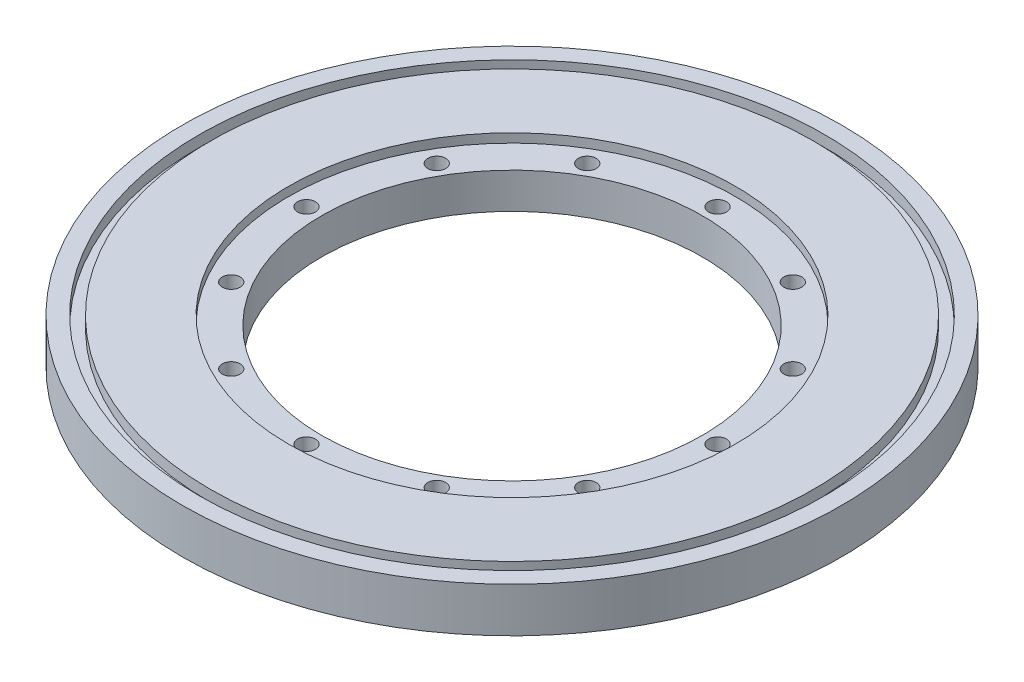
ISO-10303-21;
HEADER;
FILE_DESCRIPTION(('STEP AP214'),'2;1');
FILE_NAME('part.step','',(''),(''),'','','');
FILE_SCHEMA(('AUTOMOTIVE_DESIGN { 1 0 10303 214 1 1 1 1 }'));
ENDSEC;
DATA;
#1=APPLICATION_CONTEXT('core data for automotive mechanical design processes');
#2=APPLICATION_PROTOCOL_DEFINITION('international standard','automotive_design',2000,#1);
#3=PRODUCT_CONTEXT('',#1,'mechanical');
#4=PRODUCT('Part','Part','',(#3));
#5=PRODUCT_RELATED_PRODUCT_CATEGORY('part','',(#4));
#6=PRODUCT_DEFINITION_FORMATION('','',#4);
#7=PRODUCT_DEFINITION_CONTEXT('part definition',#1,'design');
#8=PRODUCT_DEFINITION('design','',#6,#7);
#9=PRODUCT_DEFINITION_SHAPE('','',#8);
#10=(LENGTH_UNIT() NAMED_UNIT(*) SI_UNIT(.MILLI.,.METRE.));
#11=(NAMED_UNIT(*) PLANE_ANGLE_UNIT() SI_UNIT($,.RADIAN.));
#12=(NAMED_UNIT(*) SI_UNIT($,.STERADIAN.) SOLID_ANGLE_UNIT());
#13=UNCERTAINTY_MEASURE_WITH_UNIT(LENGTH_MEASURE(1.E-05),#10,'distance_accuracy_value','');
#14=(GEOMETRIC_REPRESENTATION_CONTEXT(3) GLOBAL_UNCERTAINTY_ASSIGNED_CONTEXT((#13)) GLOBAL_UNIT_ASSIGNED_CONTEXT((#10,
#11,#12)) REPRESENTATION_CONTEXT('',''));
#15=CARTESIAN_POINT('',(0.,0.,0.));
#16=DIRECTION('',(0.,0.,1.));
#17=DIRECTION('',(1.,0.,0.));
#18=AXIS2_PLACEMENT_3D('',#15,#16,#17);
#19=CARTESIAN_POINT('',(0.,12.7,0.));
#20=DIRECTION('',(0.,1.,0.));
#21=DIRECTION('',(0.,0.,1.));
#22=AXIS2_PLACEMENT_3D('',#19,#20,#21);
#23=PLANE('',#22);
#24=CARTESIAN_POINT('',(0.,12.7,0.));
#25=DIRECTION('',(0.,1.,0.));
#26=DIRECTION('',(0.,0.,1.));
#27=AXIS2_PLACEMENT_3D('',#24,#25,#26);
#28=CIRCLE('',#27,63.5);
#29=CARTESIAN_POINT('',(0.,12.7,63.5));
#30=VERTEX_POINT('',#29);
#31=EDGE_CURVE('E57',#30,#30,#28,.T.);
#32=ORIENTED_EDGE('',*,*,#31,.F.);
#33=EDGE_LOOP('',(#32));
#34=FACE_BOUND('',#33,.T.);
#35=CARTESIAN_POINT('',(0.,12.7,0.));
#36=DIRECTION('',(0.,1.,0.));
#37=DIRECTION('',(0.,0.,1.));
#38=AXIS2_PLACEMENT_3D('',#35,#36,#37);
#39=CIRCLE('',#38,85.725);
#40=CARTESIAN_POINT('',(0.,12.7,85.725));
#41=VERTEX_POINT('',#40);
#42=EDGE_CURVE('E113',#41,#41,#39,.T.);
#43=ORIENTED_EDGE('',*,*,#42,.T.);
#44=EDGE_LOOP('',(#43));
#45=FACE_BOUND('',#44,.T.);
#46=ADVANCED_FACE('F32',(#34,#45),#23,.T.);
#47=CARTESIAN_POINT('',(0.,0.,0.));
#48=DIRECTION('',(0.,1.,0.));
#49=DIRECTION('',(0.,0.,1.));
#50=AXIS2_PLACEMENT_3D('',#47,#48,#49);
#51=CYLINDRICAL_SURFACE('',#50,54.102);
#52=CARTESIAN_POINT('',(0.,0.,0.));
#53=DIRECTION('',(0.,1.,0.));
#54=DIRECTION('',(0.,0.,1.));
#55=AXIS2_PLACEMENT_3D('',#52,#53,#54);
#56=CIRCLE('',#55,54.102);
#57=CARTESIAN_POINT('',(0.,0.,54.102));
#58=VERTEX_POINT('',#57);
#59=EDGE_CURVE('E45',#58,#58,#56,.T.);
#60=ORIENTED_EDGE('',*,*,#59,.F.);
#61=EDGE_LOOP('',(#60));
#62=FACE_BOUND('',#61,.T.);
#63=CARTESIAN_POINT('',(0.,10.16,0.));
#64=DIRECTION('',(0.,1.,0.));
#65=DIRECTION('',(0.,0.,1.));
#66=AXIS2_PLACEMENT_3D('',#63,#64,#65);
#67=CIRCLE('',#66,54.102);
#68=CARTESIAN_POINT('',(0.,10.16,54.102));
#69=VERTEX_POINT('',#68);
#70=EDGE_CURVE('E50',#69,#69,#67,.F.);
#71=ORIENTED_EDGE('',*,*,#70,.F.);
#72=EDGE_LOOP('',(#71));
#73=FACE_BOUND('',#72,.T.);
#74=ADVANCED_FACE('F108',(#62,#73),#51,.F.);
#75=CARTESIAN_POINT('',(0.,12.7,0.));
#76=DIRECTION('',(0.,-1.,0.));
#77=DIRECTION('',(0.,0.,-1.));
#78=AXIS2_PLACEMENT_3D('',#75,#76,#77);
#79=CYLINDRICAL_SURFACE('',#78,93.6625);
#80=CARTESIAN_POINT('',(0.,12.7,0.));
#81=DIRECTION('',(0.,1.,0.));
#82=DIRECTION('',(0.,0.,1.));
#83=AXIS2_PLACEMENT_3D('',#80,#81,#82);
#84=CIRCLE('',#83,93.6625);
#85=CARTESIAN_POINT('',(0.,12.7,93.6625));
#86=VERTEX_POINT('',#85);
#87=EDGE_CURVE('E10',#86,#86,#84,.T.);
#88=ORIENTED_EDGE('',*,*,#87,.F.);
#89=EDGE_LOOP('',(#88));
#90=FACE_BOUND('',#89,.T.);
#91=CARTESIAN_POINT('',(0.,0.,0.));
#92=DIRECTION('',(0.,1.,0.));
#93=DIRECTION('',(0.,0.,1.));
#94=AXIS2_PLACEMENT_3D('',#91,#92,#93);
#95=CIRCLE('',#94,93.6625);
#96=CARTESIAN_POINT('',(0.,0.,93.6625));
#97=VERTEX_POINT('',#96);
#98=EDGE_CURVE('E40',#97,#97,#95,.T.);
#99=ORIENTED_EDGE('',*,*,#98,.T.);
#100=EDGE_LOOP('',(#99));
#101=FACE_BOUND('',#100,.T.);
#102=ADVANCED_FACE('F34',(#90,#101),#79,.T.);
#103=CARTESIAN_POINT('',(0.,12.7,0.));
#104=DIRECTION('',(0.,1.,0.));
#105=DIRECTION('',(0.,0.,1.));
#106=AXIS2_PLACEMENT_3D('',#103,#104,#105);
#107=CIRCLE('',#106,88.9);
#108=CARTESIAN_POINT('',(0.,12.7,88.9));
#109=VERTEX_POINT('',#108);
#110=EDGE_CURVE('E118',#109,#109,#107,.T.);
#111=ORIENTED_EDGE('',*,*,#110,.F.);
#112=EDGE_LOOP('',(#111));
#113=FACE_BOUND('',#112,.T.);
#114=ORIENTED_EDGE('',*,*,#87,.T.);
#115=EDGE_LOOP('',(#114));
#116=FACE_BOUND('',#115,.T.);
#117=ADVANCED_FACE('F110',(#113,#116),#23,.T.);
#118=CARTESIAN_POINT('',(0.,0.,0.));
#119=DIRECTION('',(0.,1.,0.));
#120=DIRECTION('',(0.,0.,1.));
#121=AXIS2_PLACEMENT_3D('',#118,#119,#120);
#122=PLANE('',#121);
#123=CARTESIAN_POINT('',(-50.593204089087,0.,-29.2099999999999));
#124=DIRECTION('',(0.,1.,0.));
#125=DIRECTION('',(0.86602540378444,0.,0.499999999999998));
#126=AXIS2_PLACEMENT_3D('',#123,#124,#125);
#127=CIRCLE('',#126,2.54);
#128=CARTESIAN_POINT('',(-48.3934995634745,0.,-27.9399999999999));
#129=VERTEX_POINT('',#128);
#130=EDGE_CURVE('E133',#129,#129,#127,.T.);
#131=ORIENTED_EDGE('',*,*,#130,.T.);
#132=EDGE_LOOP('',(#131));
#133=FACE_BOUND('',#132,.T.);
#134=CARTESIAN_POINT('',(-58.42,0.,2.03972339815216E-13));
#135=DIRECTION('',(0.,1.,0.));
#136=DIRECTION('',(1.,0.,0.));
#137=AXIS2_PLACEMENT_3D('',#134,#135,#136);
#138=CIRCLE('',#137,2.54);
#139=CARTESIAN_POINT('',(-55.88,0.,1.95103977214554E-13));
#140=VERTEX_POINT('',#139);
#141=EDGE_CURVE('E136',#140,#140,#138,.T.);
#142=ORIENTED_EDGE('',*,*,#141,.T.);
#143=EDGE_LOOP('',(#142));
#144=FACE_BOUND('',#143,.T.);
#145=CARTESIAN_POINT('',(-50.5932040890868,0.,29.2100000000002));
#146=DIRECTION('',(0.,1.,0.));
#147=DIRECTION('',(0.866025403784436,0.,-0.500000000000004));
#148=AXIS2_PLACEMENT_3D('',#145,#146,#147);
#149=CIRCLE('',#148,2.54);
#150=CARTESIAN_POINT('',(-48.3934995634743,0.,27.9400000000002));
#151=VERTEX_POINT('',#150);
#152=EDGE_CURVE('E139',#151,#151,#149,.T.);
#153=ORIENTED_EDGE('',*,*,#152,.T.);
#154=EDGE_LOOP('',(#153));
#155=FACE_BOUND('',#154,.T.);
#156=CARTESIAN_POINT('',(-29.2099999999997,0.,50.5932040890871));
#157=DIRECTION('',(0.,1.,0.));
#158=DIRECTION('',(0.499999999999995,0.,-0.866025403784442));
#159=AXIS2_PLACEMENT_3D('',#156,#157,#158);
#160=CIRCLE('',#159,2.54);
#161=CARTESIAN_POINT('',(-27.9399999999997,0.,48.3934995634746));
#162=VERTEX_POINT('',#161);
#163=EDGE_CURVE('E142',#162,#162,#160,.T.);
#164=ORIENTED_EDGE('',*,*,#163,.T.);
#165=EDGE_LOOP('',(#164));
#166=FACE_BOUND('',#165,.T.);
#167=CARTESIAN_POINT('',(0.,0.,58.42));
#168=DIRECTION('',(0.,1.,0.));
#169=DIRECTION('',(0.,0.,-1.));
#170=AXIS2_PLACEMENT_3D('',#167,#168,#169);
#171=CIRCLE('',#170,2.54);
#172=CARTESIAN_POINT('',(0.,0.,55.88));
#173=VERTEX_POINT('',#172);
#174=EDGE_CURVE('E145',#173,#173,#171,.T.);
#175=ORIENTED_EDGE('',*,*,#174,.T.);
#176=EDGE_LOOP('',(#175));
#177=FACE_BOUND('',#176,.T.);
#178=CARTESIAN_POINT('',(29.2100000000004,0.,50.5932040890867));
#179=DIRECTION('',(0.,1.,0.));
#180=DIRECTION('',(-0.500000000000007,0.,-0.866025403784435));
#181=AXIS2_PLACEMENT_3D('',#178,#179,#180);
#182=CIRCLE('',#181,2.54);
#183=CARTESIAN_POINT('',(27.9400000000004,0.,48.3934995634742));
#184=VERTEX_POINT('',#183);
#185=EDGE_CURVE('E148',#184,#184,#182,.T.);
#186=ORIENTED_EDGE('',*,*,#185,.T.);
#187=EDGE_LOOP('',(#186));
#188=FACE_BOUND('',#187,.T.);
#189=CARTESIAN_POINT('',(50.5932040890872,0.,29.2099999999995));
#190=DIRECTION('',(0.,1.,0.));
#191=DIRECTION('',(-0.866025403784443,0.,-0.499999999999992));
#192=AXIS2_PLACEMENT_3D('',#189,#190,#191);
#193=CIRCLE('',#192,2.54);
#194=CARTESIAN_POINT('',(48.3934995634747,0.,27.9399999999995));
#195=VERTEX_POINT('',#194);
#196=EDGE_CURVE('E151',#195,#195,#193,.T.);
#197=ORIENTED_EDGE('',*,*,#196,.T.);
#198=EDGE_LOOP('',(#197));
#199=FACE_BOUND('',#198,.T.);
#200=CARTESIAN_POINT('',(58.42,0.,-6.11917019445647E-13));
#201=DIRECTION('',(0.,1.,0.));
#202=DIRECTION('',(-1.,0.,0.));
#203=AXIS2_PLACEMENT_3D('',#200,#201,#202);
#204=CIRCLE('',#203,2.54);
#205=CARTESIAN_POINT('',(55.88,0.,-5.85311931643663E-13));
#206=VERTEX_POINT('',#205);
#207=EDGE_CURVE('E130',#206,#206,#204,.T.);
#208=ORIENTED_EDGE('',*,*,#207,.T.);
#209=EDGE_LOOP('',(#208));
#210=FACE_BOUND('',#209,.T.);
#211=CARTESIAN_POINT('',(50.5932040890866,0.,-29.2100000000006));
#212=DIRECTION('',(0.,1.,0.));
#213=DIRECTION('',(-0.866025403784433,0.,0.50000000000001));
#214=AXIS2_PLACEMENT_3D('',#211,#212,#213);
#215=CIRCLE('',#214,2.54);
#216=CARTESIAN_POINT('',(48.3934995634741,0.,-27.9400000000006));
#217=VERTEX_POINT('',#216);
#218=EDGE_CURVE('E127',#217,#217,#215,.T.);
#219=ORIENTED_EDGE('',*,*,#218,.T.);
#220=EDGE_LOOP('',(#219));
#221=FACE_BOUND('',#220,.T.);
#222=CARTESIAN_POINT('',(29.2099999999993,0.,-50.5932040890873));
#223=DIRECTION('',(0.,1.,0.));
#224=DIRECTION('',(-0.499999999999989,0.,0.866025403784445));
#225=AXIS2_PLACEMENT_3D('',#222,#223,#224);
#226=CIRCLE('',#225,2.54);
#227=CARTESIAN_POINT('',(27.9399999999994,0.,-48.3934995634748));
#228=VERTEX_POINT('',#227);
#229=EDGE_CURVE('E124',#228,#228,#226,.T.);
#230=ORIENTED_EDGE('',*,*,#229,.T.);
#231=EDGE_LOOP('',(#230));
#232=FACE_BOUND('',#231,.T.);
#233=CARTESIAN_POINT('',(-29.2100000000001,0.,-50.5932040890869));
#234=DIRECTION('',(0.,1.,0.));
#235=DIRECTION('',(0.500000000000001,0.,0.866025403784438));
#236=AXIS2_PLACEMENT_3D('',#233,#234,#235);
#237=CIRCLE('',#236,2.54);
#238=CARTESIAN_POINT('',(-27.9400000000001,0.,-48.3934995634744));
#239=VERTEX_POINT('',#238);
#240=EDGE_CURVE('E63',#239,#239,#237,.T.);
#241=ORIENTED_EDGE('',*,*,#240,.T.);
#242=EDGE_LOOP('',(#241));
#243=FACE_BOUND('',#242,.T.);
#244=CARTESIAN_POINT('',(0.,0.,-58.42));
#245=DIRECTION('',(0.,1.,0.));
#246=DIRECTION('',(0.,0.,1.));
#247=AXIS2_PLACEMENT_3D('',#244,#245,#246);
#248=CIRCLE('',#247,2.54);
#249=CARTESIAN_POINT('',(0.,0.,-55.88));
#250=VERTEX_POINT('',#249);
#251=EDGE_CURVE('E58',#250,#250,#248,.T.);
#252=ORIENTED_EDGE('',*,*,#251,.T.);
#253=EDGE_LOOP('',(#252));
#254=FACE_BOUND('',#253,.T.);
#255=ORIENTED_EDGE('',*,*,#59,.T.);
#256=EDGE_LOOP('',(#255));
#257=FACE_BOUND('',#256,.T.);
#258=ORIENTED_EDGE('',*,*,#98,.F.);
#259=EDGE_LOOP('',(#258));
#260=FACE_BOUND('',#259,.T.);
#261=ADVANCED_FACE('F156',(#133,#144,#155,#166,#177,#188,#199,#210,#221,#232,#243,#254,#257,
#260),#122,.F.);
#262=CARTESIAN_POINT('',(0.,10.16,0.));
#263=DIRECTION('',(0.,1.,0.));
#264=DIRECTION('',(0.,0.,1.));
#265=AXIS2_PLACEMENT_3D('',#262,#263,#264);
#266=PLANE('',#265);
#267=CARTESIAN_POINT('',(-50.593204089087,10.16,-29.2099999999999));
#268=DIRECTION('',(0.,1.,0.));
#269=DIRECTION('',(0.,0.,1.));
#270=AXIS2_PLACEMENT_3D('',#267,#268,#269);
#271=CIRCLE('',#270,2.54);
#272=CARTESIAN_POINT('',(-50.593204089087,10.16,-26.6699999999999));
#273=VERTEX_POINT('',#272);
#274=EDGE_CURVE('E36',#273,#273,#271,.T.);
#275=ORIENTED_EDGE('',*,*,#274,.F.);
#276=EDGE_LOOP('',(#275));
#277=FACE_BOUND('',#276,.T.);
#278=CARTESIAN_POINT('',(-58.42,10.16,2.03972339815216E-13));
#279=DIRECTION('',(0.,1.,0.));
#280=DIRECTION('',(0.,0.,1.));
#281=AXIS2_PLACEMENT_3D('',#278,#279,#280);
#282=CIRCLE('',#281,2.54);
#283=CARTESIAN_POINT('',(-58.42,10.16,2.5400000000002));
#284=VERTEX_POINT('',#283);
#285=EDGE_CURVE('E86',#284,#284,#282,.T.);
#286=ORIENTED_EDGE('',*,*,#285,.F.);
#287=EDGE_LOOP('',(#286));
#288=FACE_BOUND('',#287,.T.);
#289=CARTESIAN_POINT('',(-50.5932040890868,10.16,29.2100000000002));
#290=DIRECTION('',(0.,1.,0.));
#291=DIRECTION('',(0.,0.,1.));
#292=AXIS2_PLACEMENT_3D('',#289,#290,#291);
#293=CIRCLE('',#292,2.54);
#294=CARTESIAN_POINT('',(-50.5932040890868,10.16,31.7500000000002));
#295=VERTEX_POINT('',#294);
#296=EDGE_CURVE('E84',#295,#295,#293,.T.);
#297=ORIENTED_EDGE('',*,*,#296,.F.);
#298=EDGE_LOOP('',(#297));
#299=FACE_BOUND('',#298,.T.);
#300=CARTESIAN_POINT('',(-29.2099999999997,10.16,50.5932040890871));
#301=DIRECTION('',(0.,1.,0.));
#302=DIRECTION('',(0.,0.,1.));
#303=AXIS2_PLACEMENT_3D('',#300,#301,#302);
#304=CIRCLE('',#303,2.54);
#305=CARTESIAN_POINT('',(-29.2099999999997,10.16,53.1332040890871));
#306=VERTEX_POINT('',#305);
#307=EDGE_CURVE('E81',#306,#306,#304,.T.);
#308=ORIENTED_EDGE('',*,*,#307,.F.);
#309=EDGE_LOOP('',(#308));
#310=FACE_BOUND('',#309,.T.);
#311=CARTESIAN_POINT('',(0.,10.16,58.42));
#312=DIRECTION('',(0.,1.,0.));
#313=DIRECTION('',(0.,0.,1.));
#314=AXIS2_PLACEMENT_3D('',#311,#312,#313);
#315=CIRCLE('',#314,2.54);
#316=CARTESIAN_POINT('',(0.,10.16,60.96));
#317=VERTEX_POINT('',#316);
#318=EDGE_CURVE('E78',#317,#317,#315,.T.);
#319=ORIENTED_EDGE('',*,*,#318,.F.);
#320=EDGE_LOOP('',(#319));
#321=FACE_BOUND('',#320,.T.);
#322=CARTESIAN_POINT('',(29.2100000000004,10.16,50.5932040890867));
#323=DIRECTION('',(0.,1.,0.));
#324=DIRECTION('',(0.,0.,1.));
#325=AXIS2_PLACEMENT_3D('',#322,#323,#324);
#326=CIRCLE('',#325,2.54);
#327=CARTESIAN_POINT('',(29.2100000000004,10.16,53.1332040890867));
#328=VERTEX_POINT('',#327);
#329=EDGE_CURVE('E75',#328,#328,#326,.T.);
#330=ORIENTED_EDGE('',*,*,#329,.F.);
#331=EDGE_LOOP('',(#330));
#332=FACE_BOUND('',#331,.T.);
#333=CARTESIAN_POINT('',(50.5932040890872,10.16,29.2099999999995));
#334=DIRECTION('',(0.,1.,0.));
#335=DIRECTION('',(0.,0.,1.));
#336=AXIS2_PLACEMENT_3D('',#333,#334,#335);
#337=CIRCLE('',#336,2.54);
#338=CARTESIAN_POINT('',(50.5932040890872,10.16,31.7499999999995));
#339=VERTEX_POINT('',#338);
#340=EDGE_CURVE('E72',#339,#339,#337,.T.);
#341=ORIENTED_EDGE('',*,*,#340,.F.);
#342=EDGE_LOOP('',(#341));
#343=FACE_BOUND('',#342,.T.);
#344=CARTESIAN_POINT('',(58.42,10.16,-6.11917019445647E-13));
#345=DIRECTION('',(0.,1.,0.));
#346=DIRECTION('',(0.,0.,1.));
#347=AXIS2_PLACEMENT_3D('',#344,#345,#346);
#348=CIRCLE('',#347,2.54);
#349=CARTESIAN_POINT('',(58.42,10.16,2.53999999999939));
#350=VERTEX_POINT('',#349);
#351=EDGE_CURVE('E69',#350,#350,#348,.T.);
#352=ORIENTED_EDGE('',*,*,#351,.F.);
#353=EDGE_LOOP('',(#352));
#354=FACE_BOUND('',#353,.T.);
#355=CARTESIAN_POINT('',(50.5932040890866,10.16,-29.2100000000006));
#356=DIRECTION('',(0.,1.,0.));
#357=DIRECTION('',(0.,0.,1.));
#358=AXIS2_PLACEMENT_3D('',#355,#356,#357);
#359=CIRCLE('',#358,2.54);
#360=CARTESIAN_POINT('',(50.5932040890866,10.16,-26.6700000000006));
#361=VERTEX_POINT('',#360);
#362=EDGE_CURVE('E66',#361,#361,#359,.T.);
#363=ORIENTED_EDGE('',*,*,#362,.F.);
#364=EDGE_LOOP('',(#363));
#365=FACE_BOUND('',#364,.T.);
#366=CARTESIAN_POINT('',(29.2099999999993,10.16,-50.5932040890873));
#367=DIRECTION('',(0.,1.,0.));
#368=DIRECTION('',(0.,0.,1.));
#369=AXIS2_PLACEMENT_3D('',#366,#367,#368);
#370=CIRCLE('',#369,2.54);
#371=CARTESIAN_POINT('',(29.2099999999993,10.16,-48.0532040890873));
#372=VERTEX_POINT('',#371);
#373=EDGE_CURVE('E62',#372,#372,#370,.T.);
#374=ORIENTED_EDGE('',*,*,#373,.F.);
#375=EDGE_LOOP('',(#374));
#376=FACE_BOUND('',#375,.T.);
#377=CARTESIAN_POINT('',(-29.2100000000001,10.16,-50.5932040890869));
#378=DIRECTION('',(0.,1.,0.));
#379=DIRECTION('',(0.,0.,1.));
#380=AXIS2_PLACEMENT_3D('',#377,#378,#379);
#381=CIRCLE('',#380,2.54);
#382=CARTESIAN_POINT('',(-29.2100000000001,10.16,-48.0532040890869));
#383=VERTEX_POINT('',#382);
#384=EDGE_CURVE('E59',#383,#383,#381,.T.);
#385=ORIENTED_EDGE('',*,*,#384,.F.);
#386=EDGE_LOOP('',(#385));
#387=FACE_BOUND('',#386,.T.);
#388=CARTESIAN_POINT('',(0.,10.16,-58.42));
#389=DIRECTION('',(0.,1.,0.));
#390=DIRECTION('',(0.,0.,1.));
#391=AXIS2_PLACEMENT_3D('',#388,#389,#390);
#392=CIRCLE('',#391,2.54);
#393=CARTESIAN_POINT('',(0.,10.16,-55.88));
#394=VERTEX_POINT('',#393);
#395=EDGE_CURVE('E54',#394,#394,#392,.T.);
#396=ORIENTED_EDGE('',*,*,#395,.F.);
#397=EDGE_LOOP('',(#396));
#398=FACE_BOUND('',#397,.T.);
#399=CARTESIAN_POINT('',(0.,10.16,0.));
#400=DIRECTION('',(0.,1.,0.));
#401=DIRECTION('',(0.,0.,1.));
#402=AXIS2_PLACEMENT_3D('',#399,#400,#401);
#403=CIRCLE('',#402,63.5);
#404=CARTESIAN_POINT('',(0.,10.16,63.5));
#405=VERTEX_POINT('',#404);
#406=EDGE_CURVE('E53',#405,#405,#403,.T.);
#407=ORIENTED_EDGE('',*,*,#406,.T.);
#408=EDGE_LOOP('',(#407));
#409=FACE_BOUND('',#408,.T.);
#410=ORIENTED_EDGE('',*,*,#70,.T.);
#411=EDGE_LOOP('',(#410));
#412=FACE_BOUND('',#411,.T.);
#413=ADVANCED_FACE('F185',(#277,#288,#299,#310,#321,#332,#343,#354,#365,#376,#387,#398,#409,
#412),#266,.T.);
#414=CARTESIAN_POINT('',(0.,10.16,0.));
#415=DIRECTION('',(0.,1.,0.));
#416=DIRECTION('',(0.,0.,1.));
#417=AXIS2_PLACEMENT_3D('',#414,#415,#416);
#418=CYLINDRICAL_SURFACE('',#417,63.5);
#419=ORIENTED_EDGE('',*,*,#406,.F.);
#420=EDGE_LOOP('',(#419));
#421=FACE_BOUND('',#420,.T.);
#422=ORIENTED_EDGE('',*,*,#31,.T.);
#423=EDGE_LOOP('',(#422));
#424=FACE_BOUND('',#423,.T.);
#425=ADVANCED_FACE('F104',(#421,#424),#418,.F.);
#426=CARTESIAN_POINT('',(0.,0.,-58.42));
#427=DIRECTION('',(0.,1.,0.));
#428=DIRECTION('',(0.,0.,1.));
#429=AXIS2_PLACEMENT_3D('',#426,#427,#428);
#430=CYLINDRICAL_SURFACE('',#429,2.54);
#431=ORIENTED_EDGE('',*,*,#395,.T.);
#432=EDGE_LOOP('',(#431));
#433=FACE_BOUND('',#432,.T.);
#434=ORIENTED_EDGE('',*,*,#251,.F.);
#435=EDGE_LOOP('',(#434));
#436=FACE_BOUND('',#435,.T.);
#437=ADVANCED_FACE('F180',(#433,#436),#430,.F.);
#438=CARTESIAN_POINT('',(-29.2100000000001,0.,-50.5932040890869));
#439=DIRECTION('',(0.,1.,0.));
#440=DIRECTION('',(0.,0.,1.));
#441=AXIS2_PLACEMENT_3D('',#438,#439,#440);
#442=CYLINDRICAL_SURFACE('',#441,2.54);
#443=ORIENTED_EDGE('',*,*,#384,.T.);
#444=EDGE_LOOP('',(#443));
#445=FACE_BOUND('',#444,.T.);
#446=ORIENTED_EDGE('',*,*,#240,.F.);
#447=EDGE_LOOP('',(#446));
#448=FACE_BOUND('',#447,.T.);
#449=ADVANCED_FACE('F177',(#445,#448),#442,.F.);
#450=CARTESIAN_POINT('',(29.2099999999993,0.,-50.5932040890873));
#451=DIRECTION('',(0.,1.,0.));
#452=DIRECTION('',(0.,0.,1.));
#453=AXIS2_PLACEMENT_3D('',#450,#451,#452);
#454=CYLINDRICAL_SURFACE('',#453,2.54);
#455=ORIENTED_EDGE('',*,*,#373,.T.);
#456=EDGE_LOOP('',(#455));
#457=FACE_BOUND('',#456,.T.);
#458=ORIENTED_EDGE('',*,*,#229,.F.);
#459=EDGE_LOOP('',(#458));
#460=FACE_BOUND('',#459,.T.);
#461=ADVANCED_FACE('F172',(#457,#460),#454,.F.);
#462=CARTESIAN_POINT('',(50.5932040890866,0.,-29.2100000000006));
#463=DIRECTION('',(0.,1.,0.));
#464=DIRECTION('',(0.,0.,1.));
#465=AXIS2_PLACEMENT_3D('',#462,#463,#464);
#466=CYLINDRICAL_SURFACE('',#465,2.54);
#467=ORIENTED_EDGE('',*,*,#362,.T.);
#468=EDGE_LOOP('',(#467));
#469=FACE_BOUND('',#468,.T.);
#470=ORIENTED_EDGE('',*,*,#218,.F.);
#471=EDGE_LOOP('',(#470));
#472=FACE_BOUND('',#471,.T.);
#473=ADVANCED_FACE('F162',(#469,#472),#466,.F.);
#474=CARTESIAN_POINT('',(58.42,0.,-6.11917019445647E-13));
#475=DIRECTION('',(0.,1.,0.));
#476=DIRECTION('',(0.,0.,1.));
#477=AXIS2_PLACEMENT_3D('',#474,#475,#476);
#478=CYLINDRICAL_SURFACE('',#477,2.54);
#479=ORIENTED_EDGE('',*,*,#351,.T.);
#480=EDGE_LOOP('',(#479));
#481=FACE_BOUND('',#480,.T.);
#482=ORIENTED_EDGE('',*,*,#207,.F.);
#483=EDGE_LOOP('',(#482));
#484=FACE_BOUND('',#483,.T.);
#485=ADVANCED_FACE('F159',(#481,#484),#478,.F.);
#486=CARTESIAN_POINT('',(50.5932040890872,0.,29.2099999999995));
#487=DIRECTION('',(0.,1.,0.));
#488=DIRECTION('',(0.,0.,1.));
#489=AXIS2_PLACEMENT_3D('',#486,#487,#488);
#490=CYLINDRICAL_SURFACE('',#489,2.54);
#491=ORIENTED_EDGE('',*,*,#340,.T.);
#492=EDGE_LOOP('',(#491));
#493=FACE_BOUND('',#492,.T.);
#494=ORIENTED_EDGE('',*,*,#196,.F.);
#495=EDGE_LOOP('',(#494));
#496=FACE_BOUND('',#495,.T.);
#497=ADVANCED_FACE('F161',(#493,#496),#490,.F.);
#498=CARTESIAN_POINT('',(29.2100000000004,0.,50.5932040890867));
#499=DIRECTION('',(0.,1.,0.));
#500=DIRECTION('',(0.,0.,1.));
#501=AXIS2_PLACEMENT_3D('',#498,#499,#500);
#502=CYLINDRICAL_SURFACE('',#501,2.54);
#503=ORIENTED_EDGE('',*,*,#329,.T.);
#504=EDGE_LOOP('',(#503));
#505=FACE_BOUND('',#504,.T.);
#506=ORIENTED_EDGE('',*,*,#185,.F.);
#507=EDGE_LOOP('',(#506));
#508=FACE_BOUND('',#507,.T.);
#509=ADVANCED_FACE('F169',(#505,#508),#502,.F.);
#510=CARTESIAN_POINT('',(0.,0.,58.42));
#511=DIRECTION('',(0.,1.,0.));
#512=DIRECTION('',(0.,0.,1.));
#513=AXIS2_PLACEMENT_3D('',#510,#511,#512);
#514=CYLINDRICAL_SURFACE('',#513,2.54);
#515=ORIENTED_EDGE('',*,*,#318,.T.);
#516=EDGE_LOOP('',(#515));
#517=FACE_BOUND('',#516,.T.);
#518=ORIENTED_EDGE('',*,*,#174,.F.);
#519=EDGE_LOOP('',(#518));
#520=FACE_BOUND('',#519,.T.);
#521=ADVANCED_FACE('F216',(#517,#520),#514,.F.);
#522=CARTESIAN_POINT('',(-29.2099999999997,0.,50.5932040890871));
#523=DIRECTION('',(0.,1.,0.));
#524=DIRECTION('',(0.,0.,1.));
#525=AXIS2_PLACEMENT_3D('',#522,#523,#524);
#526=CYLINDRICAL_SURFACE('',#525,2.54);
#527=ORIENTED_EDGE('',*,*,#307,.T.);
#528=EDGE_LOOP('',(#527));
#529=FACE_BOUND('',#528,.T.);
#530=ORIENTED_EDGE('',*,*,#163,.F.);
#531=EDGE_LOOP('',(#530));
#532=FACE_BOUND('',#531,.T.);
#533=ADVANCED_FACE('F221',(#529,#532),#526,.F.);
#534=CARTESIAN_POINT('',(-50.5932040890868,0.,29.2100000000002));
#535=DIRECTION('',(0.,1.,0.));
#536=DIRECTION('',(0.,0.,1.));
#537=AXIS2_PLACEMENT_3D('',#534,#535,#536);
#538=CYLINDRICAL_SURFACE('',#537,2.54);
#539=ORIENTED_EDGE('',*,*,#296,.T.);
#540=EDGE_LOOP('',(#539));
#541=FACE_BOUND('',#540,.T.);
#542=ORIENTED_EDGE('',*,*,#152,.F.);
#543=EDGE_LOOP('',(#542));
#544=FACE_BOUND('',#543,.T.);
#545=ADVANCED_FACE('F227',(#541,#544),#538,.F.);
#546=CARTESIAN_POINT('',(-58.42,0.,2.03972339815216E-13));
#547=DIRECTION('',(0.,1.,0.));
#548=DIRECTION('',(0.,0.,1.));
#549=AXIS2_PLACEMENT_3D('',#546,#547,#548);
#550=CYLINDRICAL_SURFACE('',#549,2.54);
#551=ORIENTED_EDGE('',*,*,#285,.T.);
#552=EDGE_LOOP('',(#551));
#553=FACE_BOUND('',#552,.T.);
#554=ORIENTED_EDGE('',*,*,#141,.F.);
#555=EDGE_LOOP('',(#554));
#556=FACE_BOUND('',#555,.T.);
#557=ADVANCED_FACE('F231',(#553,#556),#550,.F.);
#558=CARTESIAN_POINT('',(-50.593204089087,0.,-29.2099999999999));
#559=DIRECTION('',(0.,1.,0.));
#560=DIRECTION('',(0.,0.,1.));
#561=AXIS2_PLACEMENT_3D('',#558,#559,#560);
#562=CYLINDRICAL_SURFACE('',#561,2.54);
#563=ORIENTED_EDGE('',*,*,#274,.T.);
#564=EDGE_LOOP('',(#563));
#565=FACE_BOUND('',#564,.T.);
#566=ORIENTED_EDGE('',*,*,#130,.F.);
#567=EDGE_LOOP('',(#566));
#568=FACE_BOUND('',#567,.T.);
#569=ADVANCED_FACE('F235',(#565,#568),#562,.F.);
#570=CARTESIAN_POINT('',(0.,9.525,0.));
#571=DIRECTION('',(0.,1.,0.));
#572=DIRECTION('',(0.,0.,1.));
#573=AXIS2_PLACEMENT_3D('',#570,#571,#572);
#574=CYLINDRICAL_SURFACE('',#573,88.9);
#575=CARTESIAN_POINT('',(0.,9.525,0.));
#576=DIRECTION('',(0.,1.,0.));
#577=DIRECTION('',(0.,0.,1.));
#578=AXIS2_PLACEMENT_3D('',#575,#576,#577);
#579=CIRCLE('',#578,88.9);
#580=CARTESIAN_POINT('',(0.,9.525,88.9));
#581=VERTEX_POINT('',#580);
#582=EDGE_CURVE('E121',#581,#581,#579,.T.);
#583=ORIENTED_EDGE('',*,*,#582,.F.);
#584=EDGE_LOOP('',(#583));
#585=FACE_BOUND('',#584,.T.);
#586=ORIENTED_EDGE('',*,*,#110,.T.);
#587=EDGE_LOOP('',(#586));
#588=FACE_BOUND('',#587,.T.);
#589=ADVANCED_FACE('F238',(#585,#588),#574,.F.);
#590=CARTESIAN_POINT('',(0.,9.525,0.));
#591=DIRECTION('',(0.,1.,0.));
#592=DIRECTION('',(0.,0.,1.));
#593=AXIS2_PLACEMENT_3D('',#590,#591,#592);
#594=PLANE('',#593);
#595=CARTESIAN_POINT('',(0.,9.525,0.));
#596=DIRECTION('',(0.,1.,0.));
#597=DIRECTION('',(0.,0.,1.));
#598=AXIS2_PLACEMENT_3D('',#595,#596,#597);
#599=CIRCLE('',#598,85.725);
#600=CARTESIAN_POINT('',(0.,9.525,85.725));
#601=VERTEX_POINT('',#600);
#602=EDGE_CURVE('E115',#601,#601,#599,.T.);
#603=ORIENTED_EDGE('',*,*,#602,.F.);
#604=EDGE_LOOP('',(#603));
#605=FACE_BOUND('',#604,.T.);
#606=ORIENTED_EDGE('',*,*,#582,.T.);
#607=EDGE_LOOP('',(#606));
#608=FACE_BOUND('',#607,.T.);
#609=ADVANCED_FACE('F244',(#605,#608),#594,.T.);
#610=CARTESIAN_POINT('',(0.,9.525,0.));
#611=DIRECTION('',(0.,1.,0.));
#612=DIRECTION('',(0.,0.,1.));
#613=AXIS2_PLACEMENT_3D('',#610,#611,#612);
#614=CYLINDRICAL_SURFACE('',#613,85.725);
#615=ORIENTED_EDGE('',*,*,#602,.T.);
#616=EDGE_LOOP('',(#615));
#617=FACE_BOUND('',#616,.T.);
#618=ORIENTED_EDGE('',*,*,#42,.F.);
#619=EDGE_LOOP('',(#618));
#620=FACE_BOUND('',#619,.T.);
#621=ADVANCED_FACE('F248',(#617,#620),#614,.T.);
#622=CLOSED_SHELL('',(#46,#74,#102,#117,#261,#413,#425,#437,#449,#461,#473,#485,#497,#509,#521,
#533,#545,#557,#569,#589,#609,#621));
#623=MANIFOLD_SOLID_BREP('B2',#622);
#624=ADVANCED_BREP_SHAPE_REPRESENTATION('',(#18,#623),#14);
#625=SHAPE_DEFINITION_REPRESENTATION(#9,#624);
ENDSEC;
END-ISO-10303-21;
